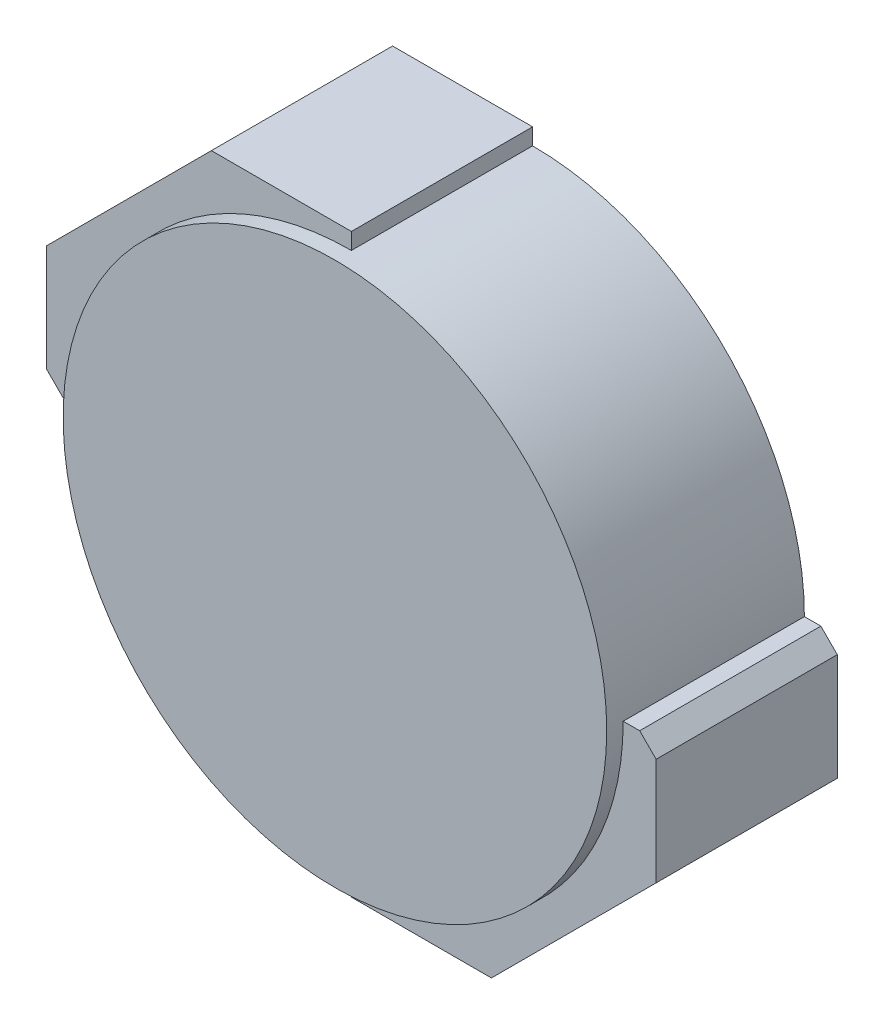
ISO-10303-21;
HEADER;
FILE_DESCRIPTION(('STEP AP214'),'2;1');
FILE_NAME('part.step','',(''),(''),'','','');
FILE_SCHEMA(('AUTOMOTIVE_DESIGN { 1 0 10303 214 1 1 1 1 }'));
ENDSEC;
DATA;
#1=APPLICATION_CONTEXT('core data for automotive mechanical design processes');
#2=APPLICATION_PROTOCOL_DEFINITION('international standard','automotive_design',2000,#1);
#3=PRODUCT_CONTEXT('',#1,'mechanical');
#4=PRODUCT('Part','Part','',(#3));
#5=PRODUCT_RELATED_PRODUCT_CATEGORY('part','',(#4));
#6=PRODUCT_DEFINITION_FORMATION('','',#4);
#7=PRODUCT_DEFINITION_CONTEXT('part definition',#1,'design');
#8=PRODUCT_DEFINITION('design','',#6,#7);
#9=PRODUCT_DEFINITION_SHAPE('','',#8);
#10=(LENGTH_UNIT() NAMED_UNIT(*) SI_UNIT(.MILLI.,.METRE.));
#11=(NAMED_UNIT(*) PLANE_ANGLE_UNIT() SI_UNIT($,.RADIAN.));
#12=(NAMED_UNIT(*) SI_UNIT($,.STERADIAN.) SOLID_ANGLE_UNIT());
#13=UNCERTAINTY_MEASURE_WITH_UNIT(LENGTH_MEASURE(1.E-05),#10,'distance_accuracy_value','');
#14=(GEOMETRIC_REPRESENTATION_CONTEXT(3) GLOBAL_UNCERTAINTY_ASSIGNED_CONTEXT((#13)) GLOBAL_UNIT_ASSIGNED_CONTEXT((#10,
#11,#12)) REPRESENTATION_CONTEXT('',''));
#15=CARTESIAN_POINT('',(0.,0.,0.));
#16=DIRECTION('',(0.,0.,1.));
#17=DIRECTION('',(1.,0.,0.));
#18=AXIS2_PLACEMENT_3D('',#15,#16,#17);
#19=CARTESIAN_POINT('',(0.,0.,1.2));
#20=DIRECTION('',(0.,0.,-1.));
#21=DIRECTION('',(-1.,0.,0.));
#22=AXIS2_PLACEMENT_3D('',#19,#20,#21);
#23=CYLINDRICAL_SURFACE('',#22,1.65);
#24=CARTESIAN_POINT('',(0.,0.,1.2));
#25=DIRECTION('',(0.,0.,1.));
#26=DIRECTION('',(1.,0.,0.));
#27=AXIS2_PLACEMENT_3D('',#24,#25,#26);
#28=CIRCLE('',#27,1.65);
#29=CARTESIAN_POINT('',(1.65,0.,1.2));
#30=VERTEX_POINT('',#29);
#31=EDGE_CURVE('E202',#30,#30,#28,.T.);
#32=ORIENTED_EDGE('',*,*,#31,.F.);
#33=EDGE_LOOP('',(#32));
#34=FACE_BOUND('',#33,.T.);
#35=DIRECTION('',(0.,0.,-1.));
#36=VECTOR('',#35,1.);
#37=CARTESIAN_POINT('',(1.65,0.,1.2));
#38=LINE('',#37,#36);
#39=CARTESIAN_POINT('',(1.65,0.,0.));
#40=VERTEX_POINT('',#39);
#41=CARTESIAN_POINT('',(1.65,0.,1.1));
#42=VERTEX_POINT('',#41);
#43=EDGE_CURVE('E172',#40,#42,#38,.F.);
#44=ORIENTED_EDGE('',*,*,#43,.F.);
#45=CARTESIAN_POINT('',(0.,0.,0.));
#46=DIRECTION('',(0.,0.,1.));
#47=DIRECTION('',(1.,0.,0.));
#48=AXIS2_PLACEMENT_3D('',#45,#46,#47);
#49=CIRCLE('',#48,1.65);
#50=CARTESIAN_POINT('',(0.,1.65,0.));
#51=VERTEX_POINT('',#50);
#52=EDGE_CURVE('E201',#40,#51,#49,.T.);
#53=ORIENTED_EDGE('',*,*,#52,.T.);
#54=DIRECTION('',(0.,0.,-1.));
#55=VECTOR('',#54,1.);
#56=CARTESIAN_POINT('',(0.,1.65,1.2));
#57=LINE('',#56,#55);
#58=CARTESIAN_POINT('',(0.,1.65,1.1));
#59=VERTEX_POINT('',#58);
#60=EDGE_CURVE('E199',#51,#59,#57,.F.);
#61=ORIENTED_EDGE('',*,*,#60,.T.);
#62=CARTESIAN_POINT('',(0.,0.,1.1));
#63=DIRECTION('',(0.,0.,1.));
#64=DIRECTION('',(1.,0.,0.));
#65=AXIS2_PLACEMENT_3D('',#62,#63,#64);
#66=CIRCLE('',#65,1.65);
#67=CARTESIAN_POINT('',(-1.65,0.,1.1));
#68=VERTEX_POINT('',#67);
#69=EDGE_CURVE('E205',#59,#68,#66,.T.);
#70=ORIENTED_EDGE('',*,*,#69,.T.);
#71=DIRECTION('',(0.,0.,-1.));
#72=VECTOR('',#71,1.);
#73=CARTESIAN_POINT('',(-1.65,0.,1.2));
#74=LINE('',#73,#72);
#75=CARTESIAN_POINT('',(-1.65,0.,0.));
#76=VERTEX_POINT('',#75);
#77=EDGE_CURVE('E196',#76,#68,#74,.F.);
#78=ORIENTED_EDGE('',*,*,#77,.F.);
#79=CARTESIAN_POINT('',(0.,-1.65,0.));
#80=VERTEX_POINT('',#79);
#81=EDGE_CURVE('E206',#76,#80,#49,.T.);
#82=ORIENTED_EDGE('',*,*,#81,.T.);
#83=DIRECTION('',(0.,0.,-1.));
#84=VECTOR('',#83,1.);
#85=CARTESIAN_POINT('',(0.,-1.65,1.2));
#86=LINE('',#85,#84);
#87=CARTESIAN_POINT('',(0.,-1.65,1.1));
#88=VERTEX_POINT('',#87);
#89=EDGE_CURVE('E144',#88,#80,#86,.T.);
#90=ORIENTED_EDGE('',*,*,#89,.F.);
#91=CARTESIAN_POINT('',(0.,0.,1.1));
#92=DIRECTION('',(0.,0.,1.));
#93=DIRECTION('',(1.,0.,0.));
#94=AXIS2_PLACEMENT_3D('',#91,#92,#93);
#95=CIRCLE('',#94,1.65);
#96=EDGE_CURVE('E210',#88,#42,#95,.T.);
#97=ORIENTED_EDGE('',*,*,#96,.T.);
#98=EDGE_LOOP('',(#44,#53,#61,#70,#78,#82,#90,#97));
#99=FACE_BOUND('',#98,.T.);
#100=ADVANCED_FACE('F35',(#34,#99),#23,.T.);
#101=CARTESIAN_POINT('',(0.,0.,1.2));
#102=DIRECTION('',(0.,0.,1.));
#103=DIRECTION('',(1.,0.,0.));
#104=AXIS2_PLACEMENT_3D('',#101,#102,#103);
#105=PLANE('',#104);
#106=ORIENTED_EDGE('',*,*,#31,.T.);
#107=EDGE_LOOP('',(#106));
#108=FACE_BOUND('',#107,.T.);
#109=ADVANCED_FACE('F278',(#108),#105,.T.);
#110=CARTESIAN_POINT('',(0.,0.,0.));
#111=DIRECTION('',(0.,0.,1.));
#112=DIRECTION('',(1.,0.,0.));
#113=AXIS2_PLACEMENT_3D('',#110,#111,#112);
#114=PLANE('',#113);
#115=DIRECTION('',(0.,-1.,0.));
#116=VECTOR('',#115,1.);
#117=CARTESIAN_POINT('',(1.85,0.,0.));
#118=LINE('',#117,#116);
#119=CARTESIAN_POINT('',(1.85,-0.0999999999999998,0.));
#120=VERTEX_POINT('',#119);
#121=CARTESIAN_POINT('',(1.85,-0.750000000000002,0.));
#122=VERTEX_POINT('',#121);
#123=EDGE_CURVE('E145',#120,#122,#118,.T.);
#124=ORIENTED_EDGE('',*,*,#123,.T.);
#125=DIRECTION('',(0.707106781186549,0.707106781186546,0.));
#126=VECTOR('',#125,1.);
#127=CARTESIAN_POINT('',(1.85,-0.750000000000002,0.));
#128=LINE('',#127,#126);
#129=CARTESIAN_POINT('',(0.849999999999998,-1.75,0.));
#130=VERTEX_POINT('',#129);
#131=EDGE_CURVE('E140',#122,#130,#128,.F.);
#132=ORIENTED_EDGE('',*,*,#131,.T.);
#133=DIRECTION('',(-1.,0.,0.));
#134=VECTOR('',#133,1.);
#135=CARTESIAN_POINT('',(0.,-1.75,0.));
#136=LINE('',#135,#134);
#137=CARTESIAN_POINT('',(0.,-1.75,0.));
#138=VERTEX_POINT('',#137);
#139=EDGE_CURVE('E134',#130,#138,#136,.T.);
#140=ORIENTED_EDGE('',*,*,#139,.T.);
#141=DIRECTION('',(0.,-1.,0.));
#142=VECTOR('',#141,1.);
#143=CARTESIAN_POINT('',(0.,0.,0.));
#144=LINE('',#143,#142);
#145=EDGE_CURVE('E139',#80,#138,#144,.T.);
#146=ORIENTED_EDGE('',*,*,#145,.F.);
#147=ORIENTED_EDGE('',*,*,#81,.F.);
#148=DIRECTION('',(1.,0.,0.));
#149=VECTOR('',#148,1.);
#150=CARTESIAN_POINT('',(0.,0.,0.));
#151=LINE('',#150,#149);
#152=CARTESIAN_POINT('',(-1.75,0.,0.));
#153=VERTEX_POINT('',#152);
#154=EDGE_CURVE('E180',#153,#76,#151,.T.);
#155=ORIENTED_EDGE('',*,*,#154,.F.);
#156=DIRECTION('',(0.707106781186545,-0.707106781186551,0.));
#157=VECTOR('',#156,1.);
#158=CARTESIAN_POINT('',(-1.75,0.,0.));
#159=LINE('',#158,#157);
#160=CARTESIAN_POINT('',(-1.85,0.0999999999999998,0.));
#161=VERTEX_POINT('',#160);
#162=EDGE_CURVE('E216',#153,#161,#159,.F.);
#163=ORIENTED_EDGE('',*,*,#162,.T.);
#164=DIRECTION('',(0.,-1.,0.));
#165=VECTOR('',#164,1.);
#166=CARTESIAN_POINT('',(-1.85,0.,0.));
#167=LINE('',#166,#165);
#168=CARTESIAN_POINT('',(-1.85,0.750000000000002,0.));
#169=VERTEX_POINT('',#168);
#170=EDGE_CURVE('E191',#169,#161,#167,.T.);
#171=ORIENTED_EDGE('',*,*,#170,.F.);
#172=DIRECTION('',(0.707106781186549,0.707106781186546,0.));
#173=VECTOR('',#172,1.);
#174=CARTESIAN_POINT('',(-1.85,0.750000000000002,0.));
#175=LINE('',#174,#173);
#176=CARTESIAN_POINT('',(-0.849999999999998,1.75,0.));
#177=VERTEX_POINT('',#176);
#178=EDGE_CURVE('E236',#169,#177,#175,.T.);
#179=ORIENTED_EDGE('',*,*,#178,.T.);
#180=DIRECTION('',(1.,0.,0.));
#181=VECTOR('',#180,1.);
#182=CARTESIAN_POINT('',(0.,1.75,0.));
#183=LINE('',#182,#181);
#184=CARTESIAN_POINT('',(0.,1.75,0.));
#185=VERTEX_POINT('',#184);
#186=EDGE_CURVE('E189',#177,#185,#183,.T.);
#187=ORIENTED_EDGE('',*,*,#186,.T.);
#188=DIRECTION('',(0.,-1.,0.));
#189=VECTOR('',#188,1.);
#190=CARTESIAN_POINT('',(0.,0.,0.));
#191=LINE('',#190,#189);
#192=EDGE_CURVE('E175',#185,#51,#191,.T.);
#193=ORIENTED_EDGE('',*,*,#192,.T.);
#194=ORIENTED_EDGE('',*,*,#52,.F.);
#195=DIRECTION('',(-1.,0.,0.));
#196=VECTOR('',#195,1.);
#197=CARTESIAN_POINT('',(0.,0.,0.));
#198=LINE('',#197,#196);
#199=CARTESIAN_POINT('',(1.75,0.,0.));
#200=VERTEX_POINT('',#199);
#201=EDGE_CURVE('E154',#200,#40,#198,.T.);
#202=ORIENTED_EDGE('',*,*,#201,.F.);
#203=DIRECTION('',(0.707106781186545,-0.707106781186551,0.));
#204=VECTOR('',#203,1.);
#205=CARTESIAN_POINT('',(1.75,0.,0.));
#206=LINE('',#205,#204);
#207=EDGE_CURVE('E219',#200,#120,#206,.T.);
#208=ORIENTED_EDGE('',*,*,#207,.T.);
#209=EDGE_LOOP('',(#124,#132,#140,#146,#147,#155,#163,#171,#179,#187,#193,#194,#202,#208));
#210=FACE_BOUND('',#209,.T.);
#211=ADVANCED_FACE('F137',(#210),#114,.F.);
#212=CARTESIAN_POINT('',(0.,0.,1.1));
#213=DIRECTION('',(1.,0.,0.));
#214=DIRECTION('',(0.,0.,-1.));
#215=AXIS2_PLACEMENT_3D('',#212,#213,#214);
#216=PLANE('',#215);
#217=ORIENTED_EDGE('',*,*,#60,.F.);
#218=ORIENTED_EDGE('',*,*,#192,.F.);
#219=DIRECTION('',(0.,0.,-1.));
#220=VECTOR('',#219,1.);
#221=CARTESIAN_POINT('',(0.,1.75,1.1));
#222=LINE('',#221,#220);
#223=CARTESIAN_POINT('',(0.,1.75,1.1));
#224=VERTEX_POINT('',#223);
#225=EDGE_CURVE('E186',#224,#185,#222,.T.);
#226=ORIENTED_EDGE('',*,*,#225,.F.);
#227=DIRECTION('',(0.,-1.,0.));
#228=VECTOR('',#227,1.);
#229=CARTESIAN_POINT('',(0.,0.,1.1));
#230=LINE('',#229,#228);
#231=EDGE_CURVE('E176',#224,#59,#230,.T.);
#232=ORIENTED_EDGE('',*,*,#231,.T.);
#233=EDGE_LOOP('',(#217,#218,#226,#232));
#234=FACE_BOUND('',#233,.T.);
#235=ADVANCED_FACE('F268',(#234),#216,.T.);
#236=CARTESIAN_POINT('',(0.,0.,1.1));
#237=DIRECTION('',(0.,1.,0.));
#238=DIRECTION('',(-1.,0.,0.));
#239=AXIS2_PLACEMENT_3D('',#236,#237,#238);
#240=PLANE('',#239);
#241=DIRECTION('',(1.,0.,0.));
#242=VECTOR('',#241,1.);
#243=CARTESIAN_POINT('',(0.,0.,1.1));
#244=LINE('',#243,#242);
#245=CARTESIAN_POINT('',(-1.75,0.,1.1));
#246=VERTEX_POINT('',#245);
#247=EDGE_CURVE('E184',#246,#68,#244,.T.);
#248=ORIENTED_EDGE('',*,*,#247,.F.);
#249=DIRECTION('',(0.,0.,-1.));
#250=VECTOR('',#249,1.);
#251=CARTESIAN_POINT('',(-1.75,0.,1.1));
#252=LINE('',#251,#250);
#253=EDGE_CURVE('E225',#246,#153,#252,.T.);
#254=ORIENTED_EDGE('',*,*,#253,.T.);
#255=ORIENTED_EDGE('',*,*,#154,.T.);
#256=ORIENTED_EDGE('',*,*,#77,.T.);
#257=EDGE_LOOP('',(#248,#254,#255,#256));
#258=FACE_BOUND('',#257,.T.);
#259=ADVANCED_FACE('F260',(#258),#240,.F.);
#260=CARTESIAN_POINT('',(0.,1.75,1.1));
#261=DIRECTION('',(0.,1.,0.));
#262=DIRECTION('',(0.,0.,1.));
#263=AXIS2_PLACEMENT_3D('',#260,#261,#262);
#264=PLANE('',#263);
#265=ORIENTED_EDGE('',*,*,#186,.F.);
#266=DIRECTION('',(0.,0.,1.));
#267=VECTOR('',#266,1.);
#268=CARTESIAN_POINT('',(-0.849999999999998,1.75,1.1));
#269=LINE('',#268,#267);
#270=CARTESIAN_POINT('',(-0.849999999999998,1.75,1.1));
#271=VERTEX_POINT('',#270);
#272=EDGE_CURVE('E43',#177,#271,#269,.T.);
#273=ORIENTED_EDGE('',*,*,#272,.T.);
#274=DIRECTION('',(1.,0.,0.));
#275=VECTOR('',#274,1.);
#276=CARTESIAN_POINT('',(0.,1.75,1.1));
#277=LINE('',#276,#275);
#278=EDGE_CURVE('E179',#271,#224,#277,.T.);
#279=ORIENTED_EDGE('',*,*,#278,.T.);
#280=ORIENTED_EDGE('',*,*,#225,.T.);
#281=EDGE_LOOP('',(#265,#273,#279,#280));
#282=FACE_BOUND('',#281,.T.);
#283=ADVANCED_FACE('F270',(#282),#264,.T.);
#284=CARTESIAN_POINT('',(-1.85,0.,1.1));
#285=DIRECTION('',(1.,0.,0.));
#286=DIRECTION('',(0.,0.,-1.));
#287=AXIS2_PLACEMENT_3D('',#284,#285,#286);
#288=PLANE('',#287);
#289=DIRECTION('',(0.,-1.,0.));
#290=VECTOR('',#289,1.);
#291=CARTESIAN_POINT('',(-1.85,0.,1.1));
#292=LINE('',#291,#290);
#293=CARTESIAN_POINT('',(-1.85,0.750000000000002,1.1));
#294=VERTEX_POINT('',#293);
#295=CARTESIAN_POINT('',(-1.85,0.0999999999999998,1.1));
#296=VERTEX_POINT('',#295);
#297=EDGE_CURVE('E182',#294,#296,#292,.T.);
#298=ORIENTED_EDGE('',*,*,#297,.F.);
#299=DIRECTION('',(0.,0.,-1.));
#300=VECTOR('',#299,1.);
#301=CARTESIAN_POINT('',(-1.85,0.750000000000002,0.));
#302=LINE('',#301,#300);
#303=EDGE_CURVE('E243',#294,#169,#302,.T.);
#304=ORIENTED_EDGE('',*,*,#303,.T.);
#305=ORIENTED_EDGE('',*,*,#170,.T.);
#306=DIRECTION('',(0.,0.,1.));
#307=VECTOR('',#306,1.);
#308=CARTESIAN_POINT('',(-1.85,0.0999999999999998,1.1));
#309=LINE('',#308,#307);
#310=EDGE_CURVE('E228',#161,#296,#309,.T.);
#311=ORIENTED_EDGE('',*,*,#310,.T.);
#312=EDGE_LOOP('',(#298,#304,#305,#311));
#313=FACE_BOUND('',#312,.T.);
#314=ADVANCED_FACE('F248',(#313),#288,.F.);
#315=CARTESIAN_POINT('',(0.,0.,1.1));
#316=DIRECTION('',(0.,0.,1.));
#317=DIRECTION('',(1.,0.,0.));
#318=AXIS2_PLACEMENT_3D('',#315,#316,#317);
#319=PLANE('',#318);
#320=ORIENTED_EDGE('',*,*,#278,.F.);
#321=DIRECTION('',(-0.707106781186549,-0.707106781186546,0.));
#322=VECTOR('',#321,1.);
#323=CARTESIAN_POINT('',(-1.3,1.3,1.1));
#324=LINE('',#323,#322);
#325=EDGE_CURVE('E11',#271,#294,#324,.T.);
#326=ORIENTED_EDGE('',*,*,#325,.T.);
#327=ORIENTED_EDGE('',*,*,#297,.T.);
#328=DIRECTION('',(-0.707106781186545,0.707106781186551,0.));
#329=VECTOR('',#328,1.);
#330=CARTESIAN_POINT('',(-0.875000000000008,-0.875000000000001,1.1));
#331=LINE('',#330,#329);
#332=EDGE_CURVE('E231',#296,#246,#331,.F.);
#333=ORIENTED_EDGE('',*,*,#332,.T.);
#334=ORIENTED_EDGE('',*,*,#247,.T.);
#335=ORIENTED_EDGE('',*,*,#69,.F.);
#336=ORIENTED_EDGE('',*,*,#231,.F.);
#337=EDGE_LOOP('',(#320,#326,#327,#333,#334,#335,#336));
#338=FACE_BOUND('',#337,.T.);
#339=ADVANCED_FACE('F257',(#338),#319,.T.);
#340=CARTESIAN_POINT('',(0.,0.,1.1));
#341=DIRECTION('',(0.,-1.,0.));
#342=DIRECTION('',(0.,0.,-1.));
#343=AXIS2_PLACEMENT_3D('',#340,#341,#342);
#344=PLANE('',#343);
#345=DIRECTION('',(-1.,0.,0.));
#346=VECTOR('',#345,1.);
#347=CARTESIAN_POINT('',(0.,0.,1.1));
#348=LINE('',#347,#346);
#349=CARTESIAN_POINT('',(1.75,0.,1.1));
#350=VERTEX_POINT('',#349);
#351=EDGE_CURVE('E162',#350,#42,#348,.T.);
#352=ORIENTED_EDGE('',*,*,#351,.F.);
#353=DIRECTION('',(0.,0.,-1.));
#354=VECTOR('',#353,1.);
#355=CARTESIAN_POINT('',(1.75,0.,0.));
#356=LINE('',#355,#354);
#357=EDGE_CURVE('E213',#350,#200,#356,.T.);
#358=ORIENTED_EDGE('',*,*,#357,.T.);
#359=ORIENTED_EDGE('',*,*,#201,.T.);
#360=ORIENTED_EDGE('',*,*,#43,.T.);
#361=EDGE_LOOP('',(#352,#358,#359,#360));
#362=FACE_BOUND('',#361,.T.);
#363=ADVANCED_FACE('F347',(#362),#344,.F.);
#364=CARTESIAN_POINT('',(0.,0.,1.1));
#365=DIRECTION('',(1.,0.,0.));
#366=DIRECTION('',(0.,1.,0.));
#367=AXIS2_PLACEMENT_3D('',#364,#365,#366);
#368=PLANE('',#367);
#369=DIRECTION('',(0.,-1.,0.));
#370=VECTOR('',#369,1.);
#371=CARTESIAN_POINT('',(0.,0.,1.1));
#372=LINE('',#371,#370);
#373=CARTESIAN_POINT('',(0.,-1.75,1.1));
#374=VERTEX_POINT('',#373);
#375=EDGE_CURVE('E166',#88,#374,#372,.T.);
#376=ORIENTED_EDGE('',*,*,#375,.F.);
#377=ORIENTED_EDGE('',*,*,#89,.T.);
#378=ORIENTED_EDGE('',*,*,#145,.T.);
#379=DIRECTION('',(0.,0.,-1.));
#380=VECTOR('',#379,1.);
#381=CARTESIAN_POINT('',(0.,-1.75,1.1));
#382=LINE('',#381,#380);
#383=EDGE_CURVE('E152',#374,#138,#382,.T.);
#384=ORIENTED_EDGE('',*,*,#383,.F.);
#385=EDGE_LOOP('',(#376,#377,#378,#384));
#386=FACE_BOUND('',#385,.T.);
#387=ADVANCED_FACE('F151',(#386),#368,.F.);
#388=CARTESIAN_POINT('',(0.,-1.75,1.1));
#389=DIRECTION('',(0.,-1.,0.));
#390=DIRECTION('',(0.,0.,-1.));
#391=AXIS2_PLACEMENT_3D('',#388,#389,#390);
#392=PLANE('',#391);
#393=ORIENTED_EDGE('',*,*,#139,.F.);
#394=DIRECTION('',(0.,0.,1.));
#395=VECTOR('',#394,1.);
#396=CARTESIAN_POINT('',(0.849999999999998,-1.75,1.1));
#397=LINE('',#396,#395);
#398=CARTESIAN_POINT('',(0.849999999999998,-1.75,1.1));
#399=VERTEX_POINT('',#398);
#400=EDGE_CURVE('E239',#130,#399,#397,.T.);
#401=ORIENTED_EDGE('',*,*,#400,.T.);
#402=DIRECTION('',(-1.,0.,0.));
#403=VECTOR('',#402,1.);
#404=CARTESIAN_POINT('',(0.,-1.75,1.1));
#405=LINE('',#404,#403);
#406=EDGE_CURVE('E153',#399,#374,#405,.T.);
#407=ORIENTED_EDGE('',*,*,#406,.T.);
#408=ORIENTED_EDGE('',*,*,#383,.T.);
#409=EDGE_LOOP('',(#393,#401,#407,#408));
#410=FACE_BOUND('',#409,.T.);
#411=ADVANCED_FACE('F156',(#410),#392,.T.);
#412=CARTESIAN_POINT('',(1.85,0.,1.1));
#413=DIRECTION('',(1.,0.,0.));
#414=DIRECTION('',(0.,0.,-1.));
#415=AXIS2_PLACEMENT_3D('',#412,#413,#414);
#416=PLANE('',#415);
#417=DIRECTION('',(0.,-1.,0.));
#418=VECTOR('',#417,1.);
#419=CARTESIAN_POINT('',(1.85,0.,1.1));
#420=LINE('',#419,#418);
#421=CARTESIAN_POINT('',(1.85,-0.0999999999999998,1.1));
#422=VERTEX_POINT('',#421);
#423=CARTESIAN_POINT('',(1.85,-0.750000000000002,1.1));
#424=VERTEX_POINT('',#423);
#425=EDGE_CURVE('E159',#422,#424,#420,.T.);
#426=ORIENTED_EDGE('',*,*,#425,.T.);
#427=DIRECTION('',(0.,0.,-1.));
#428=VECTOR('',#427,1.);
#429=CARTESIAN_POINT('',(1.85,-0.750000000000002,1.1));
#430=LINE('',#429,#428);
#431=EDGE_CURVE('E233',#424,#122,#430,.T.);
#432=ORIENTED_EDGE('',*,*,#431,.T.);
#433=ORIENTED_EDGE('',*,*,#123,.F.);
#434=DIRECTION('',(0.,0.,1.));
#435=VECTOR('',#434,1.);
#436=CARTESIAN_POINT('',(1.85,-0.0999999999999998,1.1));
#437=LINE('',#436,#435);
#438=EDGE_CURVE('E221',#120,#422,#437,.T.);
#439=ORIENTED_EDGE('',*,*,#438,.T.);
#440=EDGE_LOOP('',(#426,#432,#433,#439));
#441=FACE_BOUND('',#440,.T.);
#442=ADVANCED_FACE('F317',(#441),#416,.T.);
#443=CARTESIAN_POINT('',(0.,0.,1.1));
#444=DIRECTION('',(0.,0.,1.));
#445=DIRECTION('',(1.,0.,0.));
#446=AXIS2_PLACEMENT_3D('',#443,#444,#445);
#447=PLANE('',#446);
#448=ORIENTED_EDGE('',*,*,#406,.F.);
#449=DIRECTION('',(-0.707106781186549,-0.707106781186546,0.));
#450=VECTOR('',#449,1.);
#451=CARTESIAN_POINT('',(1.3,-1.3,1.1));
#452=LINE('',#451,#450);
#453=EDGE_CURVE('E241',#399,#424,#452,.F.);
#454=ORIENTED_EDGE('',*,*,#453,.T.);
#455=ORIENTED_EDGE('',*,*,#425,.F.);
#456=DIRECTION('',(-0.707106781186545,0.707106781186551,0.));
#457=VECTOR('',#456,1.);
#458=CARTESIAN_POINT('',(0.875000000000008,0.875000000000001,1.1));
#459=LINE('',#458,#457);
#460=EDGE_CURVE('E223',#422,#350,#459,.T.);
#461=ORIENTED_EDGE('',*,*,#460,.T.);
#462=ORIENTED_EDGE('',*,*,#351,.T.);
#463=ORIENTED_EDGE('',*,*,#96,.F.);
#464=ORIENTED_EDGE('',*,*,#375,.T.);
#465=EDGE_LOOP('',(#448,#454,#455,#461,#462,#463,#464));
#466=FACE_BOUND('',#465,.T.);
#467=ADVANCED_FACE('F292',(#466),#447,.T.);
#468=CARTESIAN_POINT('',(1.75,0.,1.1));
#469=DIRECTION('',(0.707106781186551,0.707106781186545,0.));
#470=DIRECTION('',(0.,0.,1.));
#471=AXIS2_PLACEMENT_3D('',#468,#469,#470);
#472=PLANE('',#471);
#473=ORIENTED_EDGE('',*,*,#460,.F.);
#474=ORIENTED_EDGE('',*,*,#438,.F.);
#475=ORIENTED_EDGE('',*,*,#207,.F.);
#476=ORIENTED_EDGE('',*,*,#357,.F.);
#477=EDGE_LOOP('',(#473,#474,#475,#476));
#478=FACE_BOUND('',#477,.T.);
#479=ADVANCED_FACE('F289',(#478),#472,.T.);
#480=CARTESIAN_POINT('',(-1.75,0.,1.1));
#481=DIRECTION('',(0.707106781186551,0.707106781186545,0.));
#482=DIRECTION('',(0.,0.,-1.));
#483=AXIS2_PLACEMENT_3D('',#480,#481,#482);
#484=PLANE('',#483);
#485=ORIENTED_EDGE('',*,*,#332,.F.);
#486=ORIENTED_EDGE('',*,*,#310,.F.);
#487=ORIENTED_EDGE('',*,*,#162,.F.);
#488=ORIENTED_EDGE('',*,*,#253,.F.);
#489=EDGE_LOOP('',(#485,#486,#487,#488));
#490=FACE_BOUND('',#489,.T.);
#491=ADVANCED_FACE('F255',(#490),#484,.F.);
#492=CARTESIAN_POINT('',(1.85,-0.750000000000002,1.1));
#493=DIRECTION('',(-0.707106781186546,0.707106781186549,0.));
#494=DIRECTION('',(0.,0.,-1.));
#495=AXIS2_PLACEMENT_3D('',#492,#493,#494);
#496=PLANE('',#495);
#497=ORIENTED_EDGE('',*,*,#453,.F.);
#498=ORIENTED_EDGE('',*,*,#400,.F.);
#499=ORIENTED_EDGE('',*,*,#131,.F.);
#500=ORIENTED_EDGE('',*,*,#431,.F.);
#501=EDGE_LOOP('',(#497,#498,#499,#500));
#502=FACE_BOUND('',#501,.T.);
#503=ADVANCED_FACE('F272',(#502),#496,.F.);
#504=CARTESIAN_POINT('',(-1.85,0.750000000000002,1.1));
#505=DIRECTION('',(-0.707106781186546,0.707106781186549,0.));
#506=DIRECTION('',(0.,0.,1.));
#507=AXIS2_PLACEMENT_3D('',#504,#505,#506);
#508=PLANE('',#507);
#509=ORIENTED_EDGE('',*,*,#325,.F.);
#510=ORIENTED_EDGE('',*,*,#272,.F.);
#511=ORIENTED_EDGE('',*,*,#178,.F.);
#512=ORIENTED_EDGE('',*,*,#303,.F.);
#513=EDGE_LOOP('',(#509,#510,#511,#512));
#514=FACE_BOUND('',#513,.T.);
#515=ADVANCED_FACE('F37',(#514),#508,.T.);
#516=CLOSED_SHELL('',(#100,#109,#211,#235,#259,#283,#314,#339,#363,#387,#411,#442,#467,#479,
#491,#503,#515));
#517=MANIFOLD_SOLID_BREP('B2',#516);
#518=ADVANCED_BREP_SHAPE_REPRESENTATION('',(#18,#517),#14);
#519=SHAPE_DEFINITION_REPRESENTATION(#9,#518);
ENDSEC;
END-ISO-10303-21;
